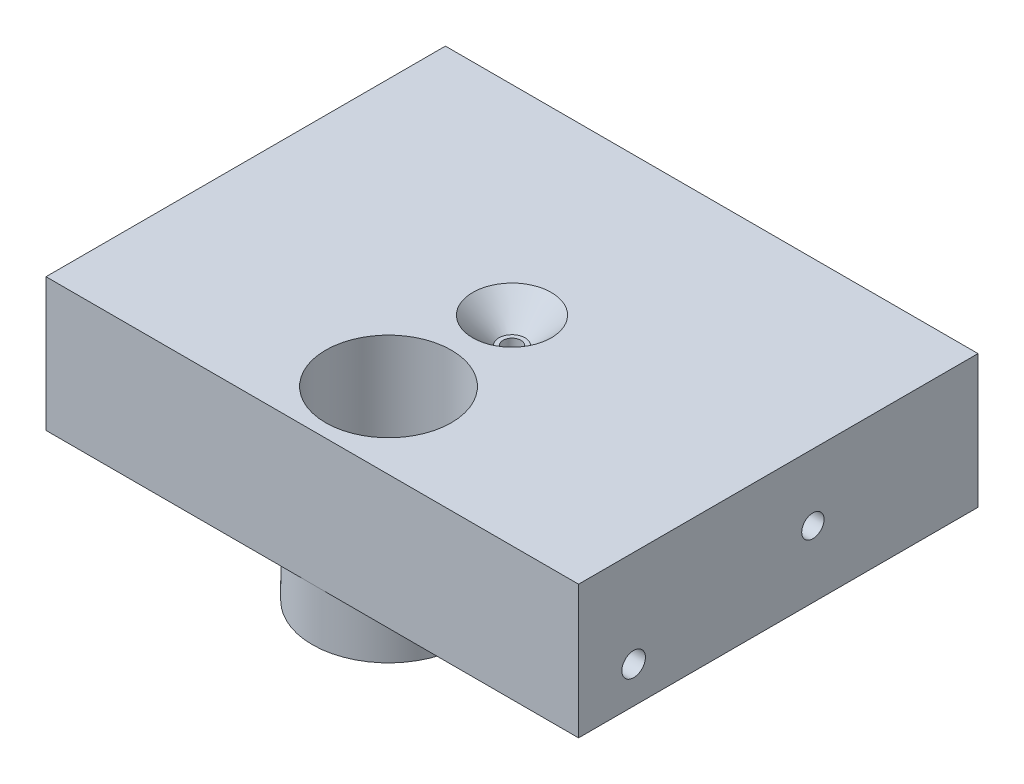
ISO-10303-21;
HEADER;
FILE_DESCRIPTION(('STEP AP214'),'2;1');
FILE_NAME('part.step','',(''),(''),'','','');
FILE_SCHEMA(('AUTOMOTIVE_DESIGN { 1 0 10303 214 1 1 1 1 }'));
ENDSEC;
DATA;
#1=APPLICATION_CONTEXT('core data for automotive mechanical design processes');
#2=APPLICATION_PROTOCOL_DEFINITION('international standard','automotive_design',2000,#1);
#3=PRODUCT_CONTEXT('',#1,'mechanical');
#4=PRODUCT('Part','Part','',(#3));
#5=PRODUCT_RELATED_PRODUCT_CATEGORY('part','',(#4));
#6=PRODUCT_DEFINITION_FORMATION('','',#4);
#7=PRODUCT_DEFINITION_CONTEXT('part definition',#1,'design');
#8=PRODUCT_DEFINITION('design','',#6,#7);
#9=PRODUCT_DEFINITION_SHAPE('','',#8);
#10=(LENGTH_UNIT() NAMED_UNIT(*) SI_UNIT(.MILLI.,.METRE.));
#11=(NAMED_UNIT(*) PLANE_ANGLE_UNIT() SI_UNIT($,.RADIAN.));
#12=(NAMED_UNIT(*) SI_UNIT($,.STERADIAN.) SOLID_ANGLE_UNIT());
#13=UNCERTAINTY_MEASURE_WITH_UNIT(LENGTH_MEASURE(1.E-05),#10,'distance_accuracy_value','');
#14=(GEOMETRIC_REPRESENTATION_CONTEXT(3) GLOBAL_UNCERTAINTY_ASSIGNED_CONTEXT((#13)) GLOBAL_UNIT_ASSIGNED_CONTEXT((#10,
#11,#12)) REPRESENTATION_CONTEXT('',''));
#15=CARTESIAN_POINT('',(0.,0.,0.));
#16=DIRECTION('',(0.,0.,1.));
#17=DIRECTION('',(1.,0.,0.));
#18=AXIS2_PLACEMENT_3D('',#15,#16,#17);
#19=CARTESIAN_POINT('',(0.,0.,0.));
#20=DIRECTION('',(0.,-1.,0.));
#21=DIRECTION('',(0.,0.,-1.));
#22=AXIS2_PLACEMENT_3D('',#19,#20,#21);
#23=CYLINDRICAL_SURFACE('',#22,1.7);
#24=CARTESIAN_POINT('',(0.,2.3,0.));
#25=DIRECTION('',(0.,-1.,0.));
#26=DIRECTION('',(0.,0.,-1.));
#27=AXIS2_PLACEMENT_3D('',#24,#25,#26);
#28=CIRCLE('',#27,1.7);
#29=CARTESIAN_POINT('',(0.,2.3,-1.7));
#30=VERTEX_POINT('',#29);
#31=EDGE_CURVE('E131',#30,#30,#28,.T.);
#32=ORIENTED_EDGE('',*,*,#31,.T.);
#33=EDGE_LOOP('',(#32));
#34=FACE_BOUND('',#33,.T.);
#35=CARTESIAN_POINT('',(0.,20.4,0.));
#36=DIRECTION('',(0.,1.,0.));
#37=DIRECTION('',(0.,0.,1.));
#38=AXIS2_PLACEMENT_3D('',#35,#36,#37);
#39=CIRCLE('',#38,1.7);
#40=CARTESIAN_POINT('',(0.,20.4,1.7));
#41=VERTEX_POINT('',#40);
#42=EDGE_CURVE('E55',#41,#41,#39,.F.);
#43=ORIENTED_EDGE('',*,*,#42,.F.);
#44=EDGE_LOOP('',(#43));
#45=FACE_BOUND('',#44,.T.);
#46=ADVANCED_FACE('F51',(#34,#45),#23,.F.);
#47=CARTESIAN_POINT('',(50.8,25.4,-38.1));
#48=DIRECTION('',(-1.,0.,0.));
#49=DIRECTION('',(0.,0.,1.));
#50=AXIS2_PLACEMENT_3D('',#47,#48,#49);
#51=PLANE('',#50);
#52=CARTESIAN_POINT('',(50.8,6.95,27.596));
#53=DIRECTION('',(-1.,0.,0.));
#54=DIRECTION('',(0.,0.,-1.));
#55=AXIS2_PLACEMENT_3D('',#52,#53,#54);
#56=CIRCLE('',#55,2.25);
#57=CARTESIAN_POINT('',(50.8,6.95,25.346));
#58=VERTEX_POINT('',#57);
#59=EDGE_CURVE('E175',#58,#58,#56,.T.);
#60=ORIENTED_EDGE('',*,*,#59,.T.);
#61=EDGE_LOOP('',(#60));
#62=FACE_BOUND('',#61,.T.);
#63=CARTESIAN_POINT('',(50.8,12.7,-6.60400000000002));
#64=DIRECTION('',(-1.,0.,0.));
#65=DIRECTION('',(0.,0.,1.));
#66=AXIS2_PLACEMENT_3D('',#63,#64,#65);
#67=CIRCLE('',#66,2.1336);
#68=CARTESIAN_POINT('',(50.8,12.7,-4.47040000000002));
#69=VERTEX_POINT('',#68);
#70=EDGE_CURVE('E152',#69,#69,#67,.T.);
#71=ORIENTED_EDGE('',*,*,#70,.T.);
#72=EDGE_LOOP('',(#71));
#73=FACE_BOUND('',#72,.T.);
#74=DIRECTION('',(0.,0.,-1.));
#75=VECTOR('',#74,1.);
#76=CARTESIAN_POINT('',(50.8,0.,-38.1));
#77=LINE('',#76,#75);
#78=CARTESIAN_POINT('',(50.8,0.,38.1));
#79=VERTEX_POINT('',#78);
#80=CARTESIAN_POINT('',(50.8,0.,-38.1));
#81=VERTEX_POINT('',#80);
#82=EDGE_CURVE('E116',#79,#81,#77,.T.);
#83=ORIENTED_EDGE('',*,*,#82,.T.);
#84=DIRECTION('',(0.,-1.,0.));
#85=VECTOR('',#84,1.);
#86=CARTESIAN_POINT('',(50.8,25.4,-38.1));
#87=LINE('',#86,#85);
#88=CARTESIAN_POINT('',(50.8,25.4,-38.1));
#89=VERTEX_POINT('',#88);
#90=EDGE_CURVE('E12',#89,#81,#87,.T.);
#91=ORIENTED_EDGE('',*,*,#90,.F.);
#92=DIRECTION('',(0.,0.,-1.));
#93=VECTOR('',#92,1.);
#94=CARTESIAN_POINT('',(50.8,25.4,-38.1));
#95=LINE('',#94,#93);
#96=CARTESIAN_POINT('',(50.8,25.4,38.1));
#97=VERTEX_POINT('',#96);
#98=EDGE_CURVE('E109',#97,#89,#95,.T.);
#99=ORIENTED_EDGE('',*,*,#98,.F.);
#100=DIRECTION('',(0.,-1.,0.));
#101=VECTOR('',#100,1.);
#102=CARTESIAN_POINT('',(50.8,25.4,38.1));
#103=LINE('',#102,#101);
#104=EDGE_CURVE('E121',#97,#79,#103,.T.);
#105=ORIENTED_EDGE('',*,*,#104,.T.);
#106=EDGE_LOOP('',(#83,#91,#99,#105));
#107=FACE_BOUND('',#106,.T.);
#108=ADVANCED_FACE('F53',(#62,#73,#107),#51,.F.);
#109=CARTESIAN_POINT('',(-50.8,25.4,-38.1));
#110=DIRECTION('',(0.,0.,1.));
#111=DIRECTION('',(1.,0.,0.));
#112=AXIS2_PLACEMENT_3D('',#109,#110,#111);
#113=PLANE('',#112);
#114=DIRECTION('',(-1.,0.,0.));
#115=VECTOR('',#114,1.);
#116=CARTESIAN_POINT('',(-50.8,0.,-38.1));
#117=LINE('',#116,#115);
#118=CARTESIAN_POINT('',(-50.8,0.,-38.1));
#119=VERTEX_POINT('',#118);
#120=EDGE_CURVE('E117',#81,#119,#117,.T.);
#121=ORIENTED_EDGE('',*,*,#120,.T.);
#122=DIRECTION('',(0.,-1.,0.));
#123=VECTOR('',#122,1.);
#124=CARTESIAN_POINT('',(-50.8,25.4,-38.1));
#125=LINE('',#124,#123);
#126=CARTESIAN_POINT('',(-50.8,25.4,-38.1));
#127=VERTEX_POINT('',#126);
#128=EDGE_CURVE('E61',#127,#119,#125,.T.);
#129=ORIENTED_EDGE('',*,*,#128,.F.);
#130=DIRECTION('',(-1.,0.,0.));
#131=VECTOR('',#130,1.);
#132=CARTESIAN_POINT('',(-50.8,25.4,-38.1));
#133=LINE('',#132,#131);
#134=EDGE_CURVE('E101',#89,#127,#133,.T.);
#135=ORIENTED_EDGE('',*,*,#134,.F.);
#136=ORIENTED_EDGE('',*,*,#90,.T.);
#137=EDGE_LOOP('',(#121,#129,#135,#136));
#138=FACE_BOUND('',#137,.T.);
#139=ADVANCED_FACE('F128',(#138),#113,.F.);
#140=CARTESIAN_POINT('',(-50.8,25.4,-38.1));
#141=DIRECTION('',(1.,0.,0.));
#142=DIRECTION('',(0.,0.,-1.));
#143=AXIS2_PLACEMENT_3D('',#140,#141,#142);
#144=PLANE('',#143);
#145=CARTESIAN_POINT('',(-50.8,6.95,27.596));
#146=DIRECTION('',(-1.,0.,0.));
#147=DIRECTION('',(0.,0.,-1.));
#148=AXIS2_PLACEMENT_3D('',#145,#146,#147);
#149=CIRCLE('',#148,2.25);
#150=CARTESIAN_POINT('',(-50.8,6.95,25.346));
#151=VERTEX_POINT('',#150);
#152=EDGE_CURVE('E169',#151,#151,#149,.T.);
#153=ORIENTED_EDGE('',*,*,#152,.F.);
#154=EDGE_LOOP('',(#153));
#155=FACE_BOUND('',#154,.T.);
#156=CARTESIAN_POINT('',(-50.8,12.7,-6.604));
#157=DIRECTION('',(-1.,0.,0.));
#158=DIRECTION('',(0.,0.,1.));
#159=AXIS2_PLACEMENT_3D('',#156,#157,#158);
#160=CIRCLE('',#159,2.1336);
#161=CARTESIAN_POINT('',(-50.8,12.7,-4.4704));
#162=VERTEX_POINT('',#161);
#163=EDGE_CURVE('E153',#162,#162,#160,.T.);
#164=ORIENTED_EDGE('',*,*,#163,.F.);
#165=EDGE_LOOP('',(#164));
#166=FACE_BOUND('',#165,.T.);
#167=DIRECTION('',(0.,0.,1.));
#168=VECTOR('',#167,1.);
#169=CARTESIAN_POINT('',(-50.8,0.,-38.1));
#170=LINE('',#169,#168);
#171=CARTESIAN_POINT('',(-50.8,0.,38.1));
#172=VERTEX_POINT('',#171);
#173=EDGE_CURVE('E87',#119,#172,#170,.T.);
#174=ORIENTED_EDGE('',*,*,#173,.T.);
#175=DIRECTION('',(0.,-1.,0.));
#176=VECTOR('',#175,1.);
#177=CARTESIAN_POINT('',(-50.8,25.4,38.1));
#178=LINE('',#177,#176);
#179=CARTESIAN_POINT('',(-50.8,25.4,38.1));
#180=VERTEX_POINT('',#179);
#181=EDGE_CURVE('E106',#180,#172,#178,.T.);
#182=ORIENTED_EDGE('',*,*,#181,.F.);
#183=DIRECTION('',(0.,0.,1.));
#184=VECTOR('',#183,1.);
#185=CARTESIAN_POINT('',(-50.8,25.4,-38.1));
#186=LINE('',#185,#184);
#187=EDGE_CURVE('E126',#127,#180,#186,.T.);
#188=ORIENTED_EDGE('',*,*,#187,.F.);
#189=ORIENTED_EDGE('',*,*,#128,.T.);
#190=EDGE_LOOP('',(#174,#182,#188,#189));
#191=FACE_BOUND('',#190,.T.);
#192=ADVANCED_FACE('F125',(#155,#166,#191),#144,.F.);
#193=CARTESIAN_POINT('',(-50.8,25.4,38.1));
#194=DIRECTION('',(0.,0.,-1.));
#195=DIRECTION('',(-1.,0.,0.));
#196=AXIS2_PLACEMENT_3D('',#193,#194,#195);
#197=PLANE('',#196);
#198=DIRECTION('',(1.,0.,0.));
#199=VECTOR('',#198,1.);
#200=CARTESIAN_POINT('',(-50.8,0.,38.1));
#201=LINE('',#200,#199);
#202=CARTESIAN_POINT('',(0.,0.,38.1));
#203=VERTEX_POINT('',#202);
#204=EDGE_CURVE('E104',#172,#203,#201,.T.);
#205=ORIENTED_EDGE('',*,*,#204,.T.);
#206=EDGE_CURVE('E94',#203,#79,#201,.T.);
#207=ORIENTED_EDGE('',*,*,#206,.T.);
#208=ORIENTED_EDGE('',*,*,#104,.F.);
#209=DIRECTION('',(1.,0.,0.));
#210=VECTOR('',#209,1.);
#211=CARTESIAN_POINT('',(-50.8,25.4,38.1));
#212=LINE('',#211,#210);
#213=EDGE_CURVE('E69',#180,#97,#212,.T.);
#214=ORIENTED_EDGE('',*,*,#213,.F.);
#215=ORIENTED_EDGE('',*,*,#181,.T.);
#216=EDGE_LOOP('',(#205,#207,#208,#214,#215));
#217=FACE_BOUND('',#216,.T.);
#218=ADVANCED_FACE('F105',(#217),#197,.F.);
#219=CARTESIAN_POINT('',(0.,25.4,0.));
#220=DIRECTION('',(0.,1.,0.));
#221=DIRECTION('',(0.,0.,1.));
#222=AXIS2_PLACEMENT_3D('',#219,#220,#221);
#223=PLANE('',#222);
#224=CARTESIAN_POINT('',(0.,25.4,23.56));
#225=DIRECTION('',(0.,1.,0.));
#226=DIRECTION('',(0.,0.,1.));
#227=AXIS2_PLACEMENT_3D('',#224,#225,#226);
#228=CIRCLE('',#227,12.);
#229=CARTESIAN_POINT('',(0.,25.4,35.56));
#230=VERTEX_POINT('',#229);
#231=EDGE_CURVE('E156',#230,#230,#228,.F.);
#232=ORIENTED_EDGE('',*,*,#231,.T.);
#233=EDGE_LOOP('',(#232));
#234=FACE_BOUND('',#233,.T.);
#235=CARTESIAN_POINT('',(0.,25.4,0.));
#236=DIRECTION('',(0.,1.,0.));
#237=DIRECTION('',(0.,0.,1.));
#238=AXIS2_PLACEMENT_3D('',#235,#236,#237);
#239=CIRCLE('',#238,7.5);
#240=CARTESIAN_POINT('',(0.,25.4,7.5));
#241=VERTEX_POINT('',#240);
#242=EDGE_CURVE('E149',#241,#241,#239,.T.);
#243=ORIENTED_EDGE('',*,*,#242,.F.);
#244=EDGE_LOOP('',(#243));
#245=FACE_BOUND('',#244,.T.);
#246=ORIENTED_EDGE('',*,*,#98,.T.);
#247=ORIENTED_EDGE('',*,*,#134,.T.);
#248=ORIENTED_EDGE('',*,*,#187,.T.);
#249=ORIENTED_EDGE('',*,*,#213,.T.);
#250=EDGE_LOOP('',(#246,#247,#248,#249));
#251=FACE_BOUND('',#250,.T.);
#252=ADVANCED_FACE('F204',(#234,#245,#251),#223,.T.);
#253=CARTESIAN_POINT('',(0.,0.,0.));
#254=DIRECTION('',(0.,1.,0.));
#255=DIRECTION('',(0.,0.,1.));
#256=AXIS2_PLACEMENT_3D('',#253,#254,#255);
#257=PLANE('',#256);
#258=CARTESIAN_POINT('',(0.,0.,0.));
#259=DIRECTION('',(0.,-1.,0.));
#260=DIRECTION('',(0.,0.,-1.));
#261=AXIS2_PLACEMENT_3D('',#258,#259,#260);
#262=CIRCLE('',#261,4.2);
#263=CARTESIAN_POINT('',(0.,0.,-4.2));
#264=VERTEX_POINT('',#263);
#265=EDGE_CURVE('E143',#264,#264,#262,.T.);
#266=ORIENTED_EDGE('',*,*,#265,.F.);
#267=EDGE_LOOP('',(#266));
#268=FACE_BOUND('',#267,.T.);
#269=ORIENTED_EDGE('',*,*,#206,.F.);
#270=CARTESIAN_POINT('',(0.,0.,23.56));
#271=DIRECTION('',(0.,-1.,0.));
#272=DIRECTION('',(-1.,0.,0.));
#273=AXIS2_PLACEMENT_3D('',#270,#271,#272);
#274=CIRCLE('',#273,14.54);
#275=EDGE_CURVE('E114',#203,#203,#274,.T.);
#276=ORIENTED_EDGE('',*,*,#275,.F.);
#277=ORIENTED_EDGE('',*,*,#204,.F.);
#278=ORIENTED_EDGE('',*,*,#173,.F.);
#279=ORIENTED_EDGE('',*,*,#120,.F.);
#280=ORIENTED_EDGE('',*,*,#82,.F.);
#281=EDGE_LOOP('',(#269,#276,#277,#278,#279,#280));
#282=FACE_BOUND('',#281,.T.);
#283=ADVANCED_FACE('F112',(#268,#282),#257,.F.);
#284=CARTESIAN_POINT('',(1.7,2.3,0.));
#285=DIRECTION('',(0.,1.,0.));
#286=DIRECTION('',(0.,0.,1.));
#287=AXIS2_PLACEMENT_3D('',#284,#285,#286);
#288=PLANE('',#287);
#289=ORIENTED_EDGE('',*,*,#31,.F.);
#290=EDGE_LOOP('',(#289));
#291=FACE_BOUND('',#290,.T.);
#292=CARTESIAN_POINT('',(0.,2.3,0.));
#293=DIRECTION('',(0.,-1.,0.));
#294=DIRECTION('',(0.,0.,-1.));
#295=AXIS2_PLACEMENT_3D('',#292,#293,#294);
#296=CIRCLE('',#295,4.2);
#297=CARTESIAN_POINT('',(0.,2.3,-4.2));
#298=VERTEX_POINT('',#297);
#299=EDGE_CURVE('E134',#298,#298,#296,.T.);
#300=ORIENTED_EDGE('',*,*,#299,.T.);
#301=EDGE_LOOP('',(#300));
#302=FACE_BOUND('',#301,.T.);
#303=ADVANCED_FACE('F202',(#291,#302),#288,.F.);
#304=CARTESIAN_POINT('',(0.,0.,0.));
#305=DIRECTION('',(0.,-1.,0.));
#306=DIRECTION('',(0.,0.,-1.));
#307=AXIS2_PLACEMENT_3D('',#304,#305,#306);
#308=CYLINDRICAL_SURFACE('',#307,4.2);
#309=ORIENTED_EDGE('',*,*,#299,.F.);
#310=EDGE_LOOP('',(#309));
#311=FACE_BOUND('',#310,.T.);
#312=ORIENTED_EDGE('',*,*,#265,.T.);
#313=EDGE_LOOP('',(#312));
#314=FACE_BOUND('',#313,.T.);
#315=ADVANCED_FACE('F246',(#311,#314),#308,.F.);
#316=CARTESIAN_POINT('',(0.,20.4,0.));
#317=DIRECTION('',(0.,1.,0.));
#318=DIRECTION('',(0.,0.,1.));
#319=AXIS2_PLACEMENT_3D('',#316,#317,#318);
#320=PLANE('',#319);
#321=CARTESIAN_POINT('',(0.,20.4,0.));
#322=DIRECTION('',(0.,1.,0.));
#323=DIRECTION('',(0.,0.,1.));
#324=AXIS2_PLACEMENT_3D('',#321,#322,#323);
#325=CIRCLE('',#324,2.49999999999998);
#326=CARTESIAN_POINT('',(0.,20.4,2.49999999999998));
#327=VERTEX_POINT('',#326);
#328=EDGE_CURVE('E146',#327,#327,#325,.T.);
#329=ORIENTED_EDGE('',*,*,#328,.T.);
#330=EDGE_LOOP('',(#329));
#331=FACE_BOUND('',#330,.T.);
#332=ORIENTED_EDGE('',*,*,#42,.T.);
#333=EDGE_LOOP('',(#332));
#334=FACE_BOUND('',#333,.T.);
#335=ADVANCED_FACE('F253',(#331,#334),#320,.T.);
#336=CARTESIAN_POINT('',(0.,25.4,0.));
#337=DIRECTION('',(0.,1.,0.));
#338=DIRECTION('',(0.,0.,1.));
#339=AXIS2_PLACEMENT_3D('',#336,#337,#338);
#340=CONICAL_SURFACE('',#339,7.5,0.78539816339745);
#341=ORIENTED_EDGE('',*,*,#328,.F.);
#342=EDGE_LOOP('',(#341));
#343=FACE_BOUND('',#342,.T.);
#344=ORIENTED_EDGE('',*,*,#242,.T.);
#345=EDGE_LOOP('',(#344));
#346=FACE_BOUND('',#345,.T.);
#347=ADVANCED_FACE('F260',(#343,#346),#340,.F.);
#348=CARTESIAN_POINT('',(50.8,12.7,-6.60400000000002));
#349=DIRECTION('',(-1.,0.,0.));
#350=DIRECTION('',(0.,0.,1.));
#351=AXIS2_PLACEMENT_3D('',#348,#349,#350);
#352=CYLINDRICAL_SURFACE('',#351,2.1336);
#353=ORIENTED_EDGE('',*,*,#70,.F.);
#354=EDGE_LOOP('',(#353));
#355=FACE_BOUND('',#354,.T.);
#356=ORIENTED_EDGE('',*,*,#163,.T.);
#357=EDGE_LOOP('',(#356));
#358=FACE_BOUND('',#357,.T.);
#359=ADVANCED_FACE('F268',(#355,#358),#352,.F.);
#360=CARTESIAN_POINT('',(0.,25.401,23.56));
#361=DIRECTION('',(0.,-1.,0.));
#362=DIRECTION('',(0.,0.,-1.));
#363=AXIS2_PLACEMENT_3D('',#360,#361,#362);
#364=CYLINDRICAL_SURFACE('',#363,12.);
#365=ORIENTED_EDGE('',*,*,#231,.F.);
#366=EDGE_LOOP('',(#365));
#367=FACE_BOUND('',#366,.T.);
#368=CARTESIAN_POINT('',(0.,-10.,23.56));
#369=DIRECTION('',(0.,-1.,0.));
#370=DIRECTION('',(0.,0.,-1.));
#371=AXIS2_PLACEMENT_3D('',#368,#369,#370);
#372=CIRCLE('',#371,12.);
#373=CARTESIAN_POINT('',(0.,-10.,11.56));
#374=VERTEX_POINT('',#373);
#375=EDGE_CURVE('E163',#374,#374,#372,.T.);
#376=ORIENTED_EDGE('',*,*,#375,.T.);
#377=EDGE_LOOP('',(#376));
#378=FACE_BOUND('',#377,.T.);
#379=ADVANCED_FACE('F276',(#367,#378),#364,.F.);
#380=CARTESIAN_POINT('',(0.,-10.,23.56));
#381=DIRECTION('',(0.,-1.,0.));
#382=DIRECTION('',(0.,0.,-1.));
#383=AXIS2_PLACEMENT_3D('',#380,#381,#382);
#384=PLANE('',#383);
#385=CARTESIAN_POINT('',(0.,-10.,23.56));
#386=DIRECTION('',(0.,-1.,0.));
#387=DIRECTION('',(-1.,0.,0.));
#388=AXIS2_PLACEMENT_3D('',#385,#386,#387);
#389=CIRCLE('',#388,14.54);
#390=CARTESIAN_POINT('',(-14.54,-10.,23.56));
#391=VERTEX_POINT('',#390);
#392=EDGE_CURVE('E161',#391,#391,#389,.T.);
#393=ORIENTED_EDGE('',*,*,#392,.T.);
#394=EDGE_LOOP('',(#393));
#395=FACE_BOUND('',#394,.T.);
#396=ORIENTED_EDGE('',*,*,#375,.F.);
#397=EDGE_LOOP('',(#396));
#398=FACE_BOUND('',#397,.T.);
#399=ADVANCED_FACE('F283',(#395,#398),#384,.T.);
#400=CARTESIAN_POINT('',(0.,-10.,23.56));
#401=DIRECTION('',(0.,1.,0.));
#402=DIRECTION('',(0.,0.,1.));
#403=AXIS2_PLACEMENT_3D('',#400,#401,#402);
#404=CYLINDRICAL_SURFACE('',#403,14.54);
#405=ORIENTED_EDGE('',*,*,#392,.F.);
#406=EDGE_LOOP('',(#405));
#407=FACE_BOUND('',#406,.T.);
#408=ORIENTED_EDGE('',*,*,#275,.T.);
#409=EDGE_LOOP('',(#408));
#410=FACE_BOUND('',#409,.T.);
#411=ADVANCED_FACE('F291',(#407,#410),#404,.T.);
#412=CARTESIAN_POINT('',(-40.8,6.95,27.596));
#413=DIRECTION('',(-1.,0.,0.));
#414=DIRECTION('',(0.,0.,1.));
#415=AXIS2_PLACEMENT_3D('',#412,#413,#414);
#416=CYLINDRICAL_SURFACE('',#415,2.25);
#417=CARTESIAN_POINT('',(-40.8,6.95,27.596));
#418=DIRECTION('',(-1.,0.,0.));
#419=DIRECTION('',(0.,0.,-1.));
#420=AXIS2_PLACEMENT_3D('',#417,#418,#419);
#421=CIRCLE('',#420,2.25);
#422=CARTESIAN_POINT('',(-40.8,6.95,25.346));
#423=VERTEX_POINT('',#422);
#424=EDGE_CURVE('E168',#423,#423,#421,.T.);
#425=ORIENTED_EDGE('',*,*,#424,.F.);
#426=EDGE_LOOP('',(#425));
#427=FACE_BOUND('',#426,.T.);
#428=ORIENTED_EDGE('',*,*,#152,.T.);
#429=EDGE_LOOP('',(#428));
#430=FACE_BOUND('',#429,.T.);
#431=ADVANCED_FACE('F298',(#427,#430),#416,.F.);
#432=CARTESIAN_POINT('',(-40.8,6.95,27.596));
#433=DIRECTION('',(1.,0.,0.));
#434=DIRECTION('',(0.,0.,-1.));
#435=AXIS2_PLACEMENT_3D('',#432,#433,#434);
#436=PLANE('',#435);
#437=ORIENTED_EDGE('',*,*,#424,.T.);
#438=EDGE_LOOP('',(#437));
#439=FACE_BOUND('',#438,.T.);
#440=ADVANCED_FACE('F190',(#439),#436,.F.);
#441=CARTESIAN_POINT('',(40.8,6.95,27.596));
#442=DIRECTION('',(1.,0.,0.));
#443=DIRECTION('',(0.,0.,-1.));
#444=AXIS2_PLACEMENT_3D('',#441,#442,#443);
#445=CYLINDRICAL_SURFACE('',#444,2.25);
#446=CARTESIAN_POINT('',(40.8,6.95,27.596));
#447=DIRECTION('',(-1.,0.,0.));
#448=DIRECTION('',(0.,0.,-1.));
#449=AXIS2_PLACEMENT_3D('',#446,#447,#448);
#450=CIRCLE('',#449,2.25);
#451=CARTESIAN_POINT('',(40.8,6.95,25.346));
#452=VERTEX_POINT('',#451);
#453=EDGE_CURVE('E172',#452,#452,#450,.T.);
#454=ORIENTED_EDGE('',*,*,#453,.T.);
#455=EDGE_LOOP('',(#454));
#456=FACE_BOUND('',#455,.T.);
#457=ORIENTED_EDGE('',*,*,#59,.F.);
#458=EDGE_LOOP('',(#457));
#459=FACE_BOUND('',#458,.T.);
#460=ADVANCED_FACE('F181',(#456,#459),#445,.F.);
#461=CARTESIAN_POINT('',(40.8,6.95,27.596));
#462=DIRECTION('',(-1.,0.,0.));
#463=DIRECTION('',(0.,0.,-1.));
#464=AXIS2_PLACEMENT_3D('',#461,#462,#463);
#465=PLANE('',#464);
#466=ORIENTED_EDGE('',*,*,#453,.F.);
#467=EDGE_LOOP('',(#466));
#468=FACE_BOUND('',#467,.T.);
#469=ADVANCED_FACE('F184',(#468),#465,.F.);
#470=CLOSED_SHELL('',(#46,#108,#139,#192,#218,#252,#283,#303,#315,#335,#347,#359,#379,#399,#411,
#431,#440,#460,#469));
#471=MANIFOLD_SOLID_BREP('B2',#470);
#472=ADVANCED_BREP_SHAPE_REPRESENTATION('',(#18,#471),#14);
#473=SHAPE_DEFINITION_REPRESENTATION(#9,#472);
ENDSEC;
END-ISO-10303-21;
